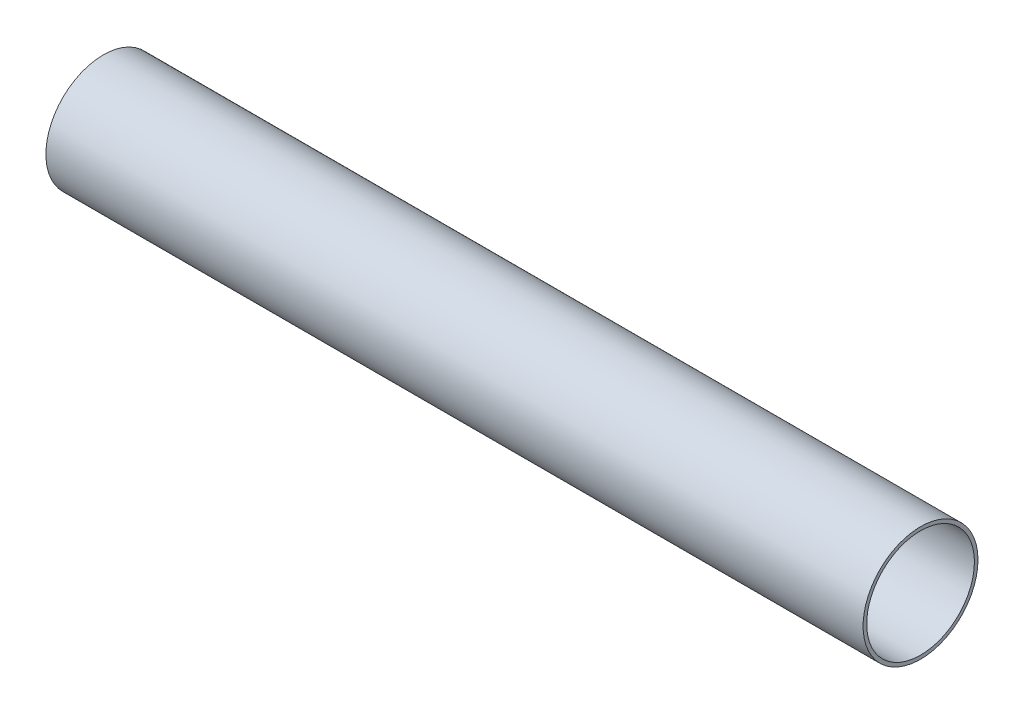
ISO-10303-21;
HEADER;
FILE_DESCRIPTION(('STEP AP214'),'2;1');
FILE_NAME('part.step','',(''),(''),'','','');
FILE_SCHEMA(('AUTOMOTIVE_DESIGN { 1 0 10303 214 1 1 1 1 }'));
ENDSEC;
DATA;
#1=APPLICATION_CONTEXT('core data for automotive mechanical design processes');
#2=APPLICATION_PROTOCOL_DEFINITION('international standard','automotive_design',2000,#1);
#3=PRODUCT_CONTEXT('',#1,'mechanical');
#4=PRODUCT('Part','Part','',(#3));
#5=PRODUCT_RELATED_PRODUCT_CATEGORY('part','',(#4));
#6=PRODUCT_DEFINITION_FORMATION('','',#4);
#7=PRODUCT_DEFINITION_CONTEXT('part definition',#1,'design');
#8=PRODUCT_DEFINITION('design','',#6,#7);
#9=PRODUCT_DEFINITION_SHAPE('','',#8);
#10=(LENGTH_UNIT() NAMED_UNIT(*) SI_UNIT(.MILLI.,.METRE.));
#11=(NAMED_UNIT(*) PLANE_ANGLE_UNIT() SI_UNIT($,.RADIAN.));
#12=(NAMED_UNIT(*) SI_UNIT($,.STERADIAN.) SOLID_ANGLE_UNIT());
#13=UNCERTAINTY_MEASURE_WITH_UNIT(LENGTH_MEASURE(1.E-05),#10,'distance_accuracy_value','');
#14=(GEOMETRIC_REPRESENTATION_CONTEXT(3) GLOBAL_UNCERTAINTY_ASSIGNED_CONTEXT((#13)) GLOBAL_UNIT_ASSIGNED_CONTEXT((#10,
#11,#12)) REPRESENTATION_CONTEXT('',''));
#15=CARTESIAN_POINT('',(0.,0.,0.));
#16=DIRECTION('',(0.,0.,1.));
#17=DIRECTION('',(1.,0.,0.));
#18=AXIS2_PLACEMENT_3D('',#15,#16,#17);
#19=CARTESIAN_POINT('',(101.6,0.,0.));
#20=DIRECTION('',(1.,0.,0.));
#21=DIRECTION('',(0.,0.,-1.));
#22=AXIS2_PLACEMENT_3D('',#19,#20,#21);
#23=PLANE('',#22);
#24=CARTESIAN_POINT('',(101.6,0.,0.));
#25=DIRECTION('',(1.,0.,0.));
#26=DIRECTION('',(0.,0.,-1.));
#27=AXIS2_PLACEMENT_3D('',#24,#25,#26);
#28=CIRCLE('',#27,14.2875);
#29=CARTESIAN_POINT('',(101.6,0.,-14.2875));
#30=VERTEX_POINT('',#29);
#31=EDGE_CURVE('E10',#30,#30,#28,.T.);
#32=ORIENTED_EDGE('',*,*,#31,.T.);
#33=EDGE_LOOP('',(#32));
#34=FACE_BOUND('',#33,.T.);
#35=CARTESIAN_POINT('',(101.6,0.,0.));
#36=DIRECTION('',(1.,0.,0.));
#37=DIRECTION('',(0.,0.,-1.));
#38=AXIS2_PLACEMENT_3D('',#35,#36,#37);
#39=CIRCLE('',#38,13.3985);
#40=CARTESIAN_POINT('',(101.6,0.,-13.3985));
#41=VERTEX_POINT('',#40);
#42=EDGE_CURVE('E50',#41,#41,#39,.T.);
#43=ORIENTED_EDGE('',*,*,#42,.F.);
#44=EDGE_LOOP('',(#43));
#45=FACE_BOUND('',#44,.T.);
#46=ADVANCED_FACE('F37',(#34,#45),#23,.T.);
#47=CARTESIAN_POINT('',(-101.6,0.,0.));
#48=DIRECTION('',(1.,0.,0.));
#49=DIRECTION('',(0.,0.,-1.));
#50=AXIS2_PLACEMENT_3D('',#47,#48,#49);
#51=PLANE('',#50);
#52=CARTESIAN_POINT('',(-101.6,0.,0.));
#53=DIRECTION('',(1.,0.,0.));
#54=DIRECTION('',(0.,0.,-1.));
#55=AXIS2_PLACEMENT_3D('',#52,#53,#54);
#56=CIRCLE('',#55,14.2875);
#57=CARTESIAN_POINT('',(-101.6,0.,-14.2875));
#58=VERTEX_POINT('',#57);
#59=EDGE_CURVE('E41',#58,#58,#56,.T.);
#60=ORIENTED_EDGE('',*,*,#59,.F.);
#61=EDGE_LOOP('',(#60));
#62=FACE_BOUND('',#61,.T.);
#63=CARTESIAN_POINT('',(-101.6,0.,0.));
#64=DIRECTION('',(1.,0.,0.));
#65=DIRECTION('',(0.,0.,-1.));
#66=AXIS2_PLACEMENT_3D('',#63,#64,#65);
#67=CIRCLE('',#66,13.3985);
#68=CARTESIAN_POINT('',(-101.6,0.,-13.3985));
#69=VERTEX_POINT('',#68);
#70=EDGE_CURVE('E52',#69,#69,#67,.T.);
#71=ORIENTED_EDGE('',*,*,#70,.T.);
#72=EDGE_LOOP('',(#71));
#73=FACE_BOUND('',#72,.T.);
#74=ADVANCED_FACE('F64',(#62,#73),#51,.F.);
#75=CARTESIAN_POINT('',(101.6,0.,0.));
#76=DIRECTION('',(-1.,0.,0.));
#77=DIRECTION('',(0.,0.,1.));
#78=AXIS2_PLACEMENT_3D('',#75,#76,#77);
#79=CYLINDRICAL_SURFACE('',#78,14.2875);
#80=ORIENTED_EDGE('',*,*,#31,.F.);
#81=EDGE_LOOP('',(#80));
#82=FACE_BOUND('',#81,.T.);
#83=ORIENTED_EDGE('',*,*,#59,.T.);
#84=EDGE_LOOP('',(#83));
#85=FACE_BOUND('',#84,.T.);
#86=ADVANCED_FACE('F39',(#82,#85),#79,.T.);
#87=CARTESIAN_POINT('',(101.6,0.,0.));
#88=DIRECTION('',(-1.,0.,0.));
#89=DIRECTION('',(0.,0.,1.));
#90=AXIS2_PLACEMENT_3D('',#87,#88,#89);
#91=CYLINDRICAL_SURFACE('',#90,13.3985);
#92=ORIENTED_EDGE('',*,*,#42,.T.);
#93=EDGE_LOOP('',(#92));
#94=FACE_BOUND('',#93,.T.);
#95=ORIENTED_EDGE('',*,*,#70,.F.);
#96=EDGE_LOOP('',(#95));
#97=FACE_BOUND('',#96,.T.);
#98=ADVANCED_FACE('F60',(#94,#97),#91,.F.);
#99=CLOSED_SHELL('',(#46,#74,#86,#98));
#100=MANIFOLD_SOLID_BREP('B2',#99);
#101=ADVANCED_BREP_SHAPE_REPRESENTATION('',(#18,#100),#14);
#102=SHAPE_DEFINITION_REPRESENTATION(#9,#101);
ENDSEC;
END-ISO-10303-21;
